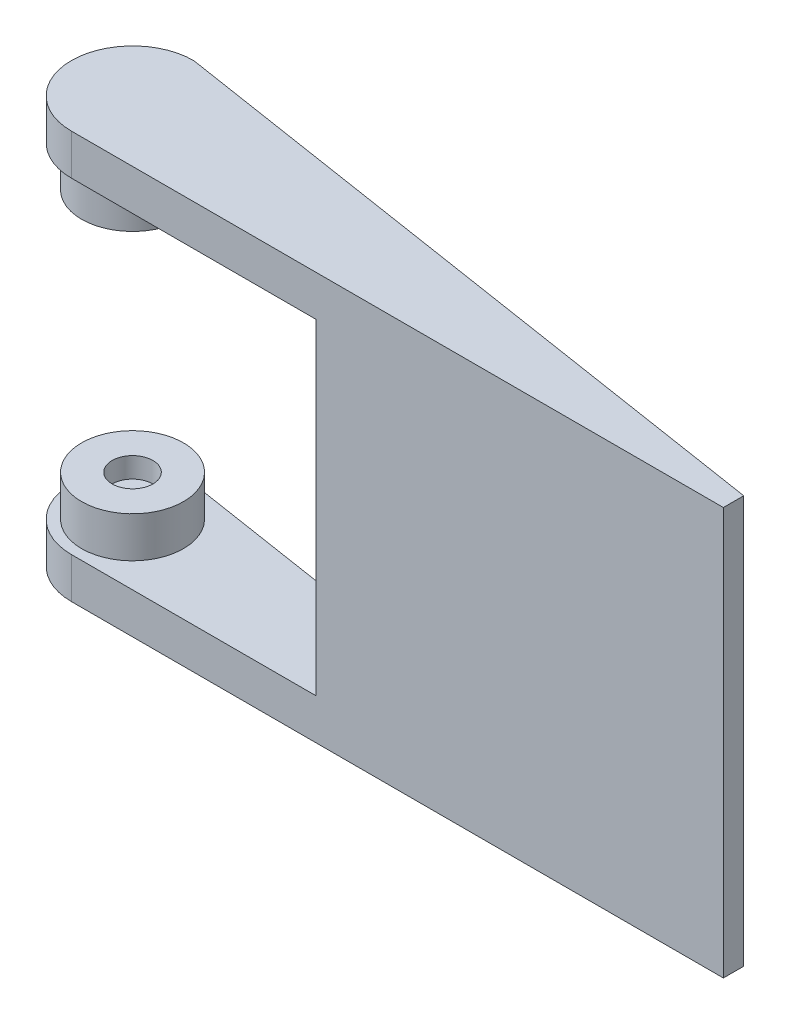
ISO-10303-21;
HEADER;
FILE_DESCRIPTION(('STEP AP214'),'2;1');
FILE_NAME('part.step','',(''),(''),'','','');
FILE_SCHEMA(('AUTOMOTIVE_DESIGN { 1 0 10303 214 1 1 1 1 }'));
ENDSEC;
DATA;
#1=APPLICATION_CONTEXT('core data for automotive mechanical design processes');
#2=APPLICATION_PROTOCOL_DEFINITION('international standard','automotive_design',2000,#1);
#3=PRODUCT_CONTEXT('',#1,'mechanical');
#4=PRODUCT('Part','Part','',(#3));
#5=PRODUCT_RELATED_PRODUCT_CATEGORY('part','',(#4));
#6=PRODUCT_DEFINITION_FORMATION('','',#4);
#7=PRODUCT_DEFINITION_CONTEXT('part definition',#1,'design');
#8=PRODUCT_DEFINITION('design','',#6,#7);
#9=PRODUCT_DEFINITION_SHAPE('','',#8);
#10=(LENGTH_UNIT() NAMED_UNIT(*) SI_UNIT(.MILLI.,.METRE.));
#11=(NAMED_UNIT(*) PLANE_ANGLE_UNIT() SI_UNIT($,.RADIAN.));
#12=(NAMED_UNIT(*) SI_UNIT($,.STERADIAN.) SOLID_ANGLE_UNIT());
#13=UNCERTAINTY_MEASURE_WITH_UNIT(LENGTH_MEASURE(1.E-05),#10,'distance_accuracy_value','');
#14=(GEOMETRIC_REPRESENTATION_CONTEXT(3) GLOBAL_UNCERTAINTY_ASSIGNED_CONTEXT((#13)) GLOBAL_UNIT_ASSIGNED_CONTEXT((#10,
#11,#12)) REPRESENTATION_CONTEXT('',''));
#15=CARTESIAN_POINT('',(0.,0.,0.));
#16=DIRECTION('',(0.,0.,1.));
#17=DIRECTION('',(1.,0.,0.));
#18=AXIS2_PLACEMENT_3D('',#15,#16,#17);
#19=CARTESIAN_POINT('',(0.,90.,0.));
#20=DIRECTION('',(0.,-1.,0.));
#21=DIRECTION('',(0.,0.,-1.));
#22=AXIS2_PLACEMENT_3D('',#19,#20,#21);
#23=CYLINDRICAL_SURFACE('',#22,12.5);
#24=CARTESIAN_POINT('',(0.,90.,0.));
#25=DIRECTION('',(0.,1.,0.));
#26=DIRECTION('',(0.,0.,1.));
#27=AXIS2_PLACEMENT_3D('',#24,#25,#26);
#28=CIRCLE('',#27,12.5);
#29=CARTESIAN_POINT('',(0.,90.,12.5));
#30=VERTEX_POINT('',#29);
#31=EDGE_CURVE('E134',#30,#30,#28,.T.);
#32=ORIENTED_EDGE('',*,*,#31,.F.);
#33=EDGE_LOOP('',(#32));
#34=FACE_BOUND('',#33,.T.);
#35=CARTESIAN_POINT('',(0.,80.,0.));
#36=DIRECTION('',(0.,1.,0.));
#37=DIRECTION('',(0.,0.,1.));
#38=AXIS2_PLACEMENT_3D('',#35,#36,#37);
#39=CIRCLE('',#38,12.5);
#40=CARTESIAN_POINT('',(0.,80.,12.5));
#41=VERTEX_POINT('',#40);
#42=EDGE_CURVE('E125',#41,#41,#39,.T.);
#43=ORIENTED_EDGE('',*,*,#42,.T.);
#44=EDGE_LOOP('',(#43));
#45=FACE_BOUND('',#44,.T.);
#46=ADVANCED_FACE('F38',(#34,#45),#23,.T.);
#47=CARTESIAN_POINT('',(0.,50.,15.));
#48=DIRECTION('',(0.,0.,-1.));
#49=DIRECTION('',(-1.,0.,0.));
#50=AXIS2_PLACEMENT_3D('',#47,#48,#49);
#51=PLANE('',#50);
#52=DIRECTION('',(1.,0.,0.));
#53=VECTOR('',#52,1.);
#54=CARTESIAN_POINT('',(0.,90.,15.));
#55=LINE('',#54,#53);
#56=CARTESIAN_POINT('',(0.,90.,15.));
#57=VERTEX_POINT('',#56);
#58=CARTESIAN_POINT('',(60.,90.,15.));
#59=VERTEX_POINT('',#58);
#60=EDGE_CURVE('E53',#57,#59,#55,.T.);
#61=ORIENTED_EDGE('',*,*,#60,.T.);
#62=DIRECTION('',(0.,1.,0.));
#63=VECTOR('',#62,1.);
#64=CARTESIAN_POINT('',(60.,10.,15.));
#65=LINE('',#64,#63);
#66=CARTESIAN_POINT('',(60.,10.,15.));
#67=VERTEX_POINT('',#66);
#68=EDGE_CURVE('E116',#67,#59,#65,.T.);
#69=ORIENTED_EDGE('',*,*,#68,.F.);
#70=DIRECTION('',(1.,0.,0.));
#71=VECTOR('',#70,1.);
#72=CARTESIAN_POINT('',(0.,10.,15.));
#73=LINE('',#72,#71);
#74=CARTESIAN_POINT('',(0.,10.,15.));
#75=VERTEX_POINT('',#74);
#76=EDGE_CURVE('E165',#75,#67,#73,.T.);
#77=ORIENTED_EDGE('',*,*,#76,.F.);
#78=DIRECTION('',(0.,-1.,0.));
#79=VECTOR('',#78,1.);
#80=CARTESIAN_POINT('',(0.,50.,15.));
#81=LINE('',#80,#79);
#82=CARTESIAN_POINT('',(0.,0.,15.));
#83=VERTEX_POINT('',#82);
#84=EDGE_CURVE('E11',#75,#83,#81,.T.);
#85=ORIENTED_EDGE('',*,*,#84,.T.);
#86=DIRECTION('',(1.,0.,0.));
#87=VECTOR('',#86,1.);
#88=CARTESIAN_POINT('',(0.,0.,15.));
#89=LINE('',#88,#87);
#90=CARTESIAN_POINT('',(160.,0.,15.));
#91=VERTEX_POINT('',#90);
#92=EDGE_CURVE('E174',#83,#91,#89,.T.);
#93=ORIENTED_EDGE('',*,*,#92,.T.);
#94=DIRECTION('',(0.,-1.,0.));
#95=VECTOR('',#94,1.);
#96=CARTESIAN_POINT('',(160.,50.,15.));
#97=LINE('',#96,#95);
#98=CARTESIAN_POINT('',(160.,100.,15.));
#99=VERTEX_POINT('',#98);
#100=EDGE_CURVE('E46',#99,#91,#97,.T.);
#101=ORIENTED_EDGE('',*,*,#100,.F.);
#102=DIRECTION('',(1.,0.,0.));
#103=VECTOR('',#102,1.);
#104=CARTESIAN_POINT('',(0.,100.,15.));
#105=LINE('',#104,#103);
#106=CARTESIAN_POINT('',(0.,100.,15.));
#107=VERTEX_POINT('',#106);
#108=EDGE_CURVE('E146',#107,#99,#105,.T.);
#109=ORIENTED_EDGE('',*,*,#108,.F.);
#110=DIRECTION('',(0.,1.,0.));
#111=VECTOR('',#110,1.);
#112=CARTESIAN_POINT('',(0.,50.,15.));
#113=LINE('',#112,#111);
#114=EDGE_CURVE('E149',#57,#107,#113,.T.);
#115=ORIENTED_EDGE('',*,*,#114,.F.);
#116=EDGE_LOOP('',(#61,#69,#77,#85,#93,#101,#109,#115));
#117=FACE_BOUND('',#116,.T.);
#118=ADVANCED_FACE('F192',(#117),#51,.F.);
#119=CARTESIAN_POINT('',(2.28789323164919,50.,-14.6425166825548));
#120=DIRECTION('',(0.15437688027361,0.,-0.988012033751101));
#121=DIRECTION('',(-0.988012033751102,0.,-0.15437688027361));
#122=AXIS2_PLACEMENT_3D('',#119,#120,#121);
#123=PLANE('',#122);
#124=DIRECTION('',(0.,1.,0.));
#125=VECTOR('',#124,1.);
#126=CARTESIAN_POINT('',(60.,10.,-5.62500000000001));
#127=LINE('',#126,#125);
#128=CARTESIAN_POINT('',(60.,10.,-5.62500000000001));
#129=VERTEX_POINT('',#128);
#130=CARTESIAN_POINT('',(60.,90.,-5.62500000000001));
#131=VERTEX_POINT('',#130);
#132=EDGE_CURVE('E105',#129,#131,#127,.T.);
#133=ORIENTED_EDGE('',*,*,#132,.T.);
#134=DIRECTION('',(-0.988012033751101,0.,-0.15437688027361));
#135=VECTOR('',#134,1.);
#136=CARTESIAN_POINT('',(2.28789323164919,90.,-14.6425166825548));
#137=LINE('',#136,#135);
#138=CARTESIAN_POINT('',(0.,90.,-15.));
#139=VERTEX_POINT('',#138);
#140=EDGE_CURVE('E109',#131,#139,#137,.T.);
#141=ORIENTED_EDGE('',*,*,#140,.T.);
#142=DIRECTION('',(0.,1.,0.));
#143=VECTOR('',#142,1.);
#144=CARTESIAN_POINT('',(0.,50.,-15.));
#145=LINE('',#144,#143);
#146=CARTESIAN_POINT('',(0.,100.,-15.));
#147=VERTEX_POINT('',#146);
#148=EDGE_CURVE('E151',#139,#147,#145,.T.);
#149=ORIENTED_EDGE('',*,*,#148,.T.);
#150=DIRECTION('',(0.988012033751102,0.,0.15437688027361));
#151=VECTOR('',#150,1.);
#152=CARTESIAN_POINT('',(2.28789323164919,100.,-14.6425166825548));
#153=LINE('',#152,#151);
#154=CARTESIAN_POINT('',(160.,100.,10.));
#155=VERTEX_POINT('',#154);
#156=EDGE_CURVE('E140',#147,#155,#153,.T.);
#157=ORIENTED_EDGE('',*,*,#156,.T.);
#158=DIRECTION('',(0.,-1.,0.));
#159=VECTOR('',#158,1.);
#160=CARTESIAN_POINT('',(160.,50.,10.));
#161=LINE('',#160,#159);
#162=CARTESIAN_POINT('',(160.,0.,10.));
#163=VERTEX_POINT('',#162);
#164=EDGE_CURVE('E184',#155,#163,#161,.T.);
#165=ORIENTED_EDGE('',*,*,#164,.T.);
#166=DIRECTION('',(0.988012033751102,0.,0.15437688027361));
#167=VECTOR('',#166,1.);
#168=CARTESIAN_POINT('',(2.28789323164919,0.,-14.6425166825548));
#169=LINE('',#168,#167);
#170=CARTESIAN_POINT('',(0.,0.,-15.));
#171=VERTEX_POINT('',#170);
#172=EDGE_CURVE('E180',#171,#163,#169,.T.);
#173=ORIENTED_EDGE('',*,*,#172,.F.);
#174=DIRECTION('',(0.,-1.,0.));
#175=VECTOR('',#174,1.);
#176=CARTESIAN_POINT('',(0.,50.,-15.));
#177=LINE('',#176,#175);
#178=CARTESIAN_POINT('',(0.,10.,-15.));
#179=VERTEX_POINT('',#178);
#180=EDGE_CURVE('E61',#179,#171,#177,.T.);
#181=ORIENTED_EDGE('',*,*,#180,.F.);
#182=DIRECTION('',(-0.988012033751101,0.,-0.15437688027361));
#183=VECTOR('',#182,1.);
#184=CARTESIAN_POINT('',(2.28789323164919,10.,-14.6425166825548));
#185=LINE('',#184,#183);
#186=EDGE_CURVE('E111',#129,#179,#185,.T.);
#187=ORIENTED_EDGE('',*,*,#186,.F.);
#188=EDGE_LOOP('',(#133,#141,#149,#157,#165,#173,#181,#187));
#189=FACE_BOUND('',#188,.T.);
#190=ADVANCED_FACE('F107',(#189),#123,.T.);
#191=CARTESIAN_POINT('',(0.,50.,0.));
#192=DIRECTION('',(0.,1.,0.));
#193=DIRECTION('',(0.,0.,1.));
#194=AXIS2_PLACEMENT_3D('',#191,#192,#193);
#195=CYLINDRICAL_SURFACE('',#194,15.);
#196=ORIENTED_EDGE('',*,*,#148,.F.);
#197=CARTESIAN_POINT('',(0.,90.,0.));
#198=DIRECTION('',(0.,1.,0.));
#199=DIRECTION('',(0.,0.,1.));
#200=AXIS2_PLACEMENT_3D('',#197,#198,#199);
#201=CIRCLE('',#200,15.);
#202=EDGE_CURVE('E124',#139,#57,#201,.T.);
#203=ORIENTED_EDGE('',*,*,#202,.T.);
#204=ORIENTED_EDGE('',*,*,#114,.T.);
#205=CARTESIAN_POINT('',(0.,100.,0.));
#206=DIRECTION('',(0.,1.,0.));
#207=DIRECTION('',(0.,0.,1.));
#208=AXIS2_PLACEMENT_3D('',#205,#206,#207);
#209=CIRCLE('',#208,15.);
#210=EDGE_CURVE('E137',#147,#107,#209,.T.);
#211=ORIENTED_EDGE('',*,*,#210,.F.);
#212=EDGE_LOOP('',(#196,#203,#204,#211));
#213=FACE_BOUND('',#212,.T.);
#214=ADVANCED_FACE('F204',(#213),#195,.T.);
#215=CARTESIAN_POINT('',(0.,10.,0.));
#216=DIRECTION('',(0.,1.,0.));
#217=DIRECTION('',(0.,0.,1.));
#218=AXIS2_PLACEMENT_3D('',#215,#216,#217);
#219=CYLINDRICAL_SURFACE('',#218,12.5);
#220=CARTESIAN_POINT('',(0.,10.,0.));
#221=DIRECTION('',(0.,1.,0.));
#222=DIRECTION('',(0.,0.,1.));
#223=AXIS2_PLACEMENT_3D('',#220,#221,#222);
#224=CIRCLE('',#223,12.5);
#225=CARTESIAN_POINT('',(0.,10.,12.5));
#226=VERTEX_POINT('',#225);
#227=EDGE_CURVE('E169',#226,#226,#224,.T.);
#228=ORIENTED_EDGE('',*,*,#227,.T.);
#229=EDGE_LOOP('',(#228));
#230=FACE_BOUND('',#229,.T.);
#231=CARTESIAN_POINT('',(0.,20.,0.));
#232=DIRECTION('',(0.,1.,0.));
#233=DIRECTION('',(0.,0.,1.));
#234=AXIS2_PLACEMENT_3D('',#231,#232,#233);
#235=CIRCLE('',#234,12.5);
#236=CARTESIAN_POINT('',(0.,20.,12.5));
#237=VERTEX_POINT('',#236);
#238=EDGE_CURVE('E157',#237,#237,#235,.T.);
#239=ORIENTED_EDGE('',*,*,#238,.F.);
#240=EDGE_LOOP('',(#239));
#241=FACE_BOUND('',#240,.T.);
#242=ADVANCED_FACE('F206',(#230,#241),#219,.T.);
#243=CARTESIAN_POINT('',(0.,50.,0.));
#244=DIRECTION('',(0.,-1.,0.));
#245=DIRECTION('',(0.,0.,-1.));
#246=AXIS2_PLACEMENT_3D('',#243,#244,#245);
#247=CYLINDRICAL_SURFACE('',#246,15.);
#248=CARTESIAN_POINT('',(0.,10.,0.));
#249=DIRECTION('',(0.,1.,0.));
#250=DIRECTION('',(0.,0.,1.));
#251=AXIS2_PLACEMENT_3D('',#248,#249,#250);
#252=CIRCLE('',#251,15.);
#253=EDGE_CURVE('E163',#179,#75,#252,.T.);
#254=ORIENTED_EDGE('',*,*,#253,.F.);
#255=ORIENTED_EDGE('',*,*,#180,.T.);
#256=CARTESIAN_POINT('',(0.,0.,0.));
#257=DIRECTION('',(0.,1.,0.));
#258=DIRECTION('',(0.,0.,1.));
#259=AXIS2_PLACEMENT_3D('',#256,#257,#258);
#260=CIRCLE('',#259,15.);
#261=EDGE_CURVE('E115',#171,#83,#260,.T.);
#262=ORIENTED_EDGE('',*,*,#261,.T.);
#263=ORIENTED_EDGE('',*,*,#84,.F.);
#264=EDGE_LOOP('',(#254,#255,#262,#263));
#265=FACE_BOUND('',#264,.T.);
#266=ADVANCED_FACE('F40',(#265),#247,.T.);
#267=CARTESIAN_POINT('',(160.,50.,0.));
#268=DIRECTION('',(1.,0.,0.));
#269=DIRECTION('',(0.,0.,-1.));
#270=AXIS2_PLACEMENT_3D('',#267,#268,#269);
#271=PLANE('',#270);
#272=DIRECTION('',(0.,0.,1.));
#273=VECTOR('',#272,1.);
#274=CARTESIAN_POINT('',(160.,0.,0.));
#275=LINE('',#274,#273);
#276=EDGE_CURVE('E177',#163,#91,#275,.T.);
#277=ORIENTED_EDGE('',*,*,#276,.F.);
#278=ORIENTED_EDGE('',*,*,#164,.F.);
#279=DIRECTION('',(0.,0.,1.));
#280=VECTOR('',#279,1.);
#281=CARTESIAN_POINT('',(160.,100.,0.));
#282=LINE('',#281,#280);
#283=EDGE_CURVE('E143',#155,#99,#282,.T.);
#284=ORIENTED_EDGE('',*,*,#283,.T.);
#285=ORIENTED_EDGE('',*,*,#100,.T.);
#286=EDGE_LOOP('',(#277,#278,#284,#285));
#287=FACE_BOUND('',#286,.T.);
#288=ADVANCED_FACE('F187',(#287),#271,.T.);
#289=CARTESIAN_POINT('',(0.,0.,0.));
#290=DIRECTION('',(0.,1.,0.));
#291=DIRECTION('',(0.,0.,1.));
#292=AXIS2_PLACEMENT_3D('',#289,#290,#291);
#293=PLANE('',#292);
#294=ORIENTED_EDGE('',*,*,#261,.F.);
#295=ORIENTED_EDGE('',*,*,#172,.T.);
#296=ORIENTED_EDGE('',*,*,#276,.T.);
#297=ORIENTED_EDGE('',*,*,#92,.F.);
#298=EDGE_LOOP('',(#294,#295,#296,#297));
#299=FACE_BOUND('',#298,.T.);
#300=ADVANCED_FACE('F196',(#299),#293,.F.);
#301=CARTESIAN_POINT('',(60.,10.,0.));
#302=DIRECTION('',(1.,0.,0.));
#303=DIRECTION('',(0.,0.,-1.));
#304=AXIS2_PLACEMENT_3D('',#301,#302,#303);
#305=PLANE('',#304);
#306=ORIENTED_EDGE('',*,*,#68,.T.);
#307=DIRECTION('',(0.,0.,-1.));
#308=VECTOR('',#307,1.);
#309=CARTESIAN_POINT('',(60.,90.,0.));
#310=LINE('',#309,#308);
#311=EDGE_CURVE('E118',#59,#131,#310,.T.);
#312=ORIENTED_EDGE('',*,*,#311,.T.);
#313=ORIENTED_EDGE('',*,*,#132,.F.);
#314=DIRECTION('',(0.,0.,-1.));
#315=VECTOR('',#314,1.);
#316=CARTESIAN_POINT('',(60.,10.,0.));
#317=LINE('',#316,#315);
#318=EDGE_CURVE('E167',#67,#129,#317,.T.);
#319=ORIENTED_EDGE('',*,*,#318,.F.);
#320=EDGE_LOOP('',(#306,#312,#313,#319));
#321=FACE_BOUND('',#320,.T.);
#322=ADVANCED_FACE('F119',(#321),#305,.F.);
#323=CARTESIAN_POINT('',(0.,10.,0.));
#324=DIRECTION('',(0.,1.,0.));
#325=DIRECTION('',(0.,0.,1.));
#326=AXIS2_PLACEMENT_3D('',#323,#324,#325);
#327=PLANE('',#326);
#328=ORIENTED_EDGE('',*,*,#186,.T.);
#329=ORIENTED_EDGE('',*,*,#253,.T.);
#330=ORIENTED_EDGE('',*,*,#76,.T.);
#331=ORIENTED_EDGE('',*,*,#318,.T.);
#332=EDGE_LOOP('',(#328,#329,#330,#331));
#333=FACE_BOUND('',#332,.T.);
#334=ORIENTED_EDGE('',*,*,#227,.F.);
#335=EDGE_LOOP('',(#334));
#336=FACE_BOUND('',#335,.T.);
#337=ADVANCED_FACE('F245',(#333,#336),#327,.T.);
#338=CARTESIAN_POINT('',(0.,20.,0.));
#339=DIRECTION('',(0.,1.,0.));
#340=DIRECTION('',(0.,0.,1.));
#341=AXIS2_PLACEMENT_3D('',#338,#339,#340);
#342=PLANE('',#341);
#343=CARTESIAN_POINT('',(0.,20.,0.));
#344=DIRECTION('',(0.,1.,0.));
#345=DIRECTION('',(0.,0.,1.));
#346=AXIS2_PLACEMENT_3D('',#343,#344,#345);
#347=CIRCLE('',#346,5.);
#348=CARTESIAN_POINT('',(0.,20.,5.));
#349=VERTEX_POINT('',#348);
#350=EDGE_CURVE('E153',#349,#349,#347,.T.);
#351=ORIENTED_EDGE('',*,*,#350,.F.);
#352=EDGE_LOOP('',(#351));
#353=FACE_BOUND('',#352,.T.);
#354=ORIENTED_EDGE('',*,*,#238,.T.);
#355=EDGE_LOOP('',(#354));
#356=FACE_BOUND('',#355,.T.);
#357=ADVANCED_FACE('F239',(#353,#356),#342,.T.);
#358=CARTESIAN_POINT('',(0.,15.,0.));
#359=DIRECTION('',(0.,1.,0.));
#360=DIRECTION('',(0.,0.,1.));
#361=AXIS2_PLACEMENT_3D('',#358,#359,#360);
#362=CYLINDRICAL_SURFACE('',#361,5.);
#363=CARTESIAN_POINT('',(0.,15.,0.));
#364=DIRECTION('',(0.,1.,0.));
#365=DIRECTION('',(0.,0.,1.));
#366=AXIS2_PLACEMENT_3D('',#363,#364,#365);
#367=CIRCLE('',#366,5.);
#368=CARTESIAN_POINT('',(0.,15.,5.));
#369=VERTEX_POINT('',#368);
#370=EDGE_CURVE('E154',#369,#369,#367,.T.);
#371=ORIENTED_EDGE('',*,*,#370,.F.);
#372=EDGE_LOOP('',(#371));
#373=FACE_BOUND('',#372,.T.);
#374=ORIENTED_EDGE('',*,*,#350,.T.);
#375=EDGE_LOOP('',(#374));
#376=FACE_BOUND('',#375,.T.);
#377=ADVANCED_FACE('F234',(#373,#376),#362,.F.);
#378=CARTESIAN_POINT('',(0.,15.,0.));
#379=DIRECTION('',(0.,1.,0.));
#380=DIRECTION('',(0.,0.,1.));
#381=AXIS2_PLACEMENT_3D('',#378,#379,#380);
#382=PLANE('',#381);
#383=ORIENTED_EDGE('',*,*,#370,.T.);
#384=EDGE_LOOP('',(#383));
#385=FACE_BOUND('',#384,.T.);
#386=ADVANCED_FACE('F228',(#385),#382,.T.);
#387=CARTESIAN_POINT('',(0.,100.,0.));
#388=DIRECTION('',(0.,-1.,0.));
#389=DIRECTION('',(0.,0.,1.));
#390=AXIS2_PLACEMENT_3D('',#387,#388,#389);
#391=PLANE('',#390);
#392=ORIENTED_EDGE('',*,*,#210,.T.);
#393=ORIENTED_EDGE('',*,*,#108,.T.);
#394=ORIENTED_EDGE('',*,*,#283,.F.);
#395=ORIENTED_EDGE('',*,*,#156,.F.);
#396=EDGE_LOOP('',(#392,#393,#394,#395));
#397=FACE_BOUND('',#396,.T.);
#398=ADVANCED_FACE('F201',(#397),#391,.F.);
#399=CARTESIAN_POINT('',(0.,90.,0.));
#400=DIRECTION('',(0.,-1.,0.));
#401=DIRECTION('',(0.,0.,1.));
#402=AXIS2_PLACEMENT_3D('',#399,#400,#401);
#403=PLANE('',#402);
#404=ORIENTED_EDGE('',*,*,#140,.F.);
#405=ORIENTED_EDGE('',*,*,#311,.F.);
#406=ORIENTED_EDGE('',*,*,#60,.F.);
#407=ORIENTED_EDGE('',*,*,#202,.F.);
#408=EDGE_LOOP('',(#404,#405,#406,#407));
#409=FACE_BOUND('',#408,.T.);
#410=ORIENTED_EDGE('',*,*,#31,.T.);
#411=EDGE_LOOP('',(#410));
#412=FACE_BOUND('',#411,.T.);
#413=ADVANCED_FACE('F122',(#409,#412),#403,.T.);
#414=CARTESIAN_POINT('',(0.,80.,0.));
#415=DIRECTION('',(0.,-1.,0.));
#416=DIRECTION('',(0.,0.,1.));
#417=AXIS2_PLACEMENT_3D('',#414,#415,#416);
#418=PLANE('',#417);
#419=CARTESIAN_POINT('',(0.,80.,0.));
#420=DIRECTION('',(0.,1.,0.));
#421=DIRECTION('',(0.,0.,1.));
#422=AXIS2_PLACEMENT_3D('',#419,#420,#421);
#423=CIRCLE('',#422,5.);
#424=CARTESIAN_POINT('',(0.,80.,5.));
#425=VERTEX_POINT('',#424);
#426=EDGE_CURVE('E439',#425,#425,#423,.T.);
#427=ORIENTED_EDGE('',*,*,#426,.T.);
#428=EDGE_LOOP('',(#427));
#429=FACE_BOUND('',#428,.T.);
#430=ORIENTED_EDGE('',*,*,#42,.F.);
#431=EDGE_LOOP('',(#430));
#432=FACE_BOUND('',#431,.T.);
#433=ADVANCED_FACE('F233',(#429,#432),#418,.T.);
#434=CARTESIAN_POINT('',(0.,85.,0.));
#435=DIRECTION('',(0.,-1.,0.));
#436=DIRECTION('',(0.,0.,-1.));
#437=AXIS2_PLACEMENT_3D('',#434,#435,#436);
#438=CYLINDRICAL_SURFACE('',#437,5.);
#439=CARTESIAN_POINT('',(0.,85.,0.));
#440=DIRECTION('',(0.,1.,0.));
#441=DIRECTION('',(0.,0.,1.));
#442=AXIS2_PLACEMENT_3D('',#439,#440,#441);
#443=CIRCLE('',#442,5.);
#444=CARTESIAN_POINT('',(0.,85.,5.));
#445=VERTEX_POINT('',#444);
#446=EDGE_CURVE('E128',#445,#445,#443,.T.);
#447=ORIENTED_EDGE('',*,*,#446,.T.);
#448=EDGE_LOOP('',(#447));
#449=FACE_BOUND('',#448,.T.);
#450=ORIENTED_EDGE('',*,*,#426,.F.);
#451=EDGE_LOOP('',(#450));
#452=FACE_BOUND('',#451,.T.);
#453=ADVANCED_FACE('F301',(#449,#452),#438,.F.);
#454=CARTESIAN_POINT('',(0.,85.,0.));
#455=DIRECTION('',(0.,-1.,0.));
#456=DIRECTION('',(0.,0.,1.));
#457=AXIS2_PLACEMENT_3D('',#454,#455,#456);
#458=PLANE('',#457);
#459=ORIENTED_EDGE('',*,*,#446,.F.);
#460=EDGE_LOOP('',(#459));
#461=FACE_BOUND('',#460,.T.);
#462=ADVANCED_FACE('F311',(#461),#458,.T.);
#463=CLOSED_SHELL('',(#46,#118,#190,#214,#242,#266,#288,#300,#322,#337,#357,#377,#386,#398,#413,
#433,#453,#462));
#464=MANIFOLD_SOLID_BREP('B2',#463);
#465=ADVANCED_BREP_SHAPE_REPRESENTATION('',(#18,#464),#14);
#466=SHAPE_DEFINITION_REPRESENTATION(#9,#465);
ENDSEC;
END-ISO-10303-21;
